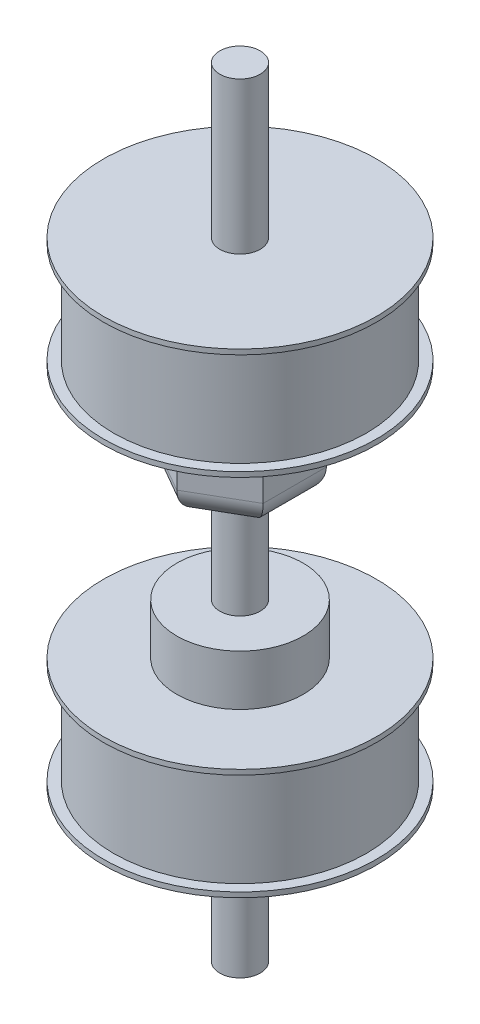
ISO-10303-21;
HEADER;
FILE_DESCRIPTION(('STEP AP214'),'2;1');
FILE_NAME('part.step','',(''),(''),'','','');
FILE_SCHEMA(('AUTOMOTIVE_DESIGN { 1 0 10303 214 1 1 1 1 }'));
ENDSEC;
DATA;
#1=APPLICATION_CONTEXT('core data for automotive mechanical design processes');
#2=APPLICATION_PROTOCOL_DEFINITION('international standard','automotive_design',2000,#1);
#3=PRODUCT_CONTEXT('',#1,'mechanical');
#4=PRODUCT('Part','Part','',(#3));
#5=PRODUCT_RELATED_PRODUCT_CATEGORY('part','',(#4));
#6=PRODUCT_DEFINITION_FORMATION('','',#4);
#7=PRODUCT_DEFINITION_CONTEXT('part definition',#1,'design');
#8=PRODUCT_DEFINITION('design','',#6,#7);
#9=PRODUCT_DEFINITION_SHAPE('','',#8);
#10=(LENGTH_UNIT() NAMED_UNIT(*) SI_UNIT(.MILLI.,.METRE.));
#11=(NAMED_UNIT(*) PLANE_ANGLE_UNIT() SI_UNIT($,.RADIAN.));
#12=(NAMED_UNIT(*) SI_UNIT($,.STERADIAN.) SOLID_ANGLE_UNIT());
#13=UNCERTAINTY_MEASURE_WITH_UNIT(LENGTH_MEASURE(1.E-05),#10,'distance_accuracy_value','');
#14=(GEOMETRIC_REPRESENTATION_CONTEXT(3) GLOBAL_UNCERTAINTY_ASSIGNED_CONTEXT((#13)) GLOBAL_UNIT_ASSIGNED_CONTEXT((#10,
#11,#12)) REPRESENTATION_CONTEXT('',''));
#15=CARTESIAN_POINT('',(0.,0.,0.));
#16=DIRECTION('',(0.,0.,1.));
#17=DIRECTION('',(1.,0.,0.));
#18=AXIS2_PLACEMENT_3D('',#15,#16,#17);
#19=CARTESIAN_POINT('',(0.,-21.,0.));
#20=DIRECTION('',(0.,-1.,0.));
#21=DIRECTION('',(0.,0.,-1.));
#22=AXIS2_PLACEMENT_3D('',#19,#20,#21);
#23=PLANE('',#22);
#24=CARTESIAN_POINT('',(0.,-21.,0.));
#25=DIRECTION('',(0.,-1.,0.));
#26=DIRECTION('',(0.,0.,-1.));
#27=AXIS2_PLACEMENT_3D('',#24,#25,#26);
#28=CIRCLE('',#27,27.);
#29=CARTESIAN_POINT('',(0.,-21.,-27.));
#30=VERTEX_POINT('',#29);
#31=EDGE_CURVE('E469',#30,#30,#28,.T.);
#32=ORIENTED_EDGE('',*,*,#31,.T.);
#33=EDGE_LOOP('',(#32));
#34=FACE_BOUND('',#33,.T.);
#35=CARTESIAN_POINT('',(0.,-21.,0.));
#36=DIRECTION('',(0.,-1.,0.));
#37=DIRECTION('',(0.,0.,-1.));
#38=AXIS2_PLACEMENT_3D('',#35,#36,#37);
#39=CIRCLE('',#38,4.);
#40=CARTESIAN_POINT('',(0.,-21.,-4.));
#41=VERTEX_POINT('',#40);
#42=EDGE_CURVE('E466',#41,#41,#39,.T.);
#43=ORIENTED_EDGE('',*,*,#42,.F.);
#44=EDGE_LOOP('',(#43));
#45=FACE_BOUND('',#44,.T.);
#46=ADVANCED_FACE('F33',(#34,#45),#23,.T.);
#47=CARTESIAN_POINT('',(0.,0.,0.));
#48=DIRECTION('',(0.,1.,0.));
#49=DIRECTION('',(0.,0.,1.));
#50=AXIS2_PLACEMENT_3D('',#47,#48,#49);
#51=PLANE('',#50);
#52=CARTESIAN_POINT('',(0.,0.,0.));
#53=DIRECTION('',(0.,1.,0.));
#54=DIRECTION('',(0.,0.,1.));
#55=AXIS2_PLACEMENT_3D('',#52,#53,#54);
#56=CIRCLE('',#55,27.);
#57=CARTESIAN_POINT('',(0.,0.,27.));
#58=VERTEX_POINT('',#57);
#59=EDGE_CURVE('E153',#58,#58,#56,.T.);
#60=ORIENTED_EDGE('',*,*,#59,.F.);
#61=EDGE_LOOP('',(#60));
#62=FACE_BOUND('',#61,.T.);
#63=CARTESIAN_POINT('',(0.,0.,0.));
#64=DIRECTION('',(0.,1.,0.));
#65=DIRECTION('',(0.,0.,1.));
#66=AXIS2_PLACEMENT_3D('',#63,#64,#65);
#67=CIRCLE('',#66,25.);
#68=CARTESIAN_POINT('',(0.,0.,25.));
#69=VERTEX_POINT('',#68);
#70=EDGE_CURVE('E11',#69,#69,#67,.F.);
#71=ORIENTED_EDGE('',*,*,#70,.F.);
#72=EDGE_LOOP('',(#71));
#73=FACE_BOUND('',#72,.T.);
#74=ADVANCED_FACE('F240',(#62,#73),#51,.F.);
#75=CARTESIAN_POINT('',(0.,73.,0.));
#76=DIRECTION('',(0.,1.,0.));
#77=DIRECTION('',(0.,0.,1.));
#78=AXIS2_PLACEMENT_3D('',#75,#76,#77);
#79=PLANE('',#78);
#80=CARTESIAN_POINT('',(0.,73.,0.));
#81=DIRECTION('',(0.,1.,0.));
#82=DIRECTION('',(0.,0.,1.));
#83=AXIS2_PLACEMENT_3D('',#80,#81,#82);
#84=CIRCLE('',#83,27.);
#85=CARTESIAN_POINT('',(0.,73.,27.));
#86=VERTEX_POINT('',#85);
#87=EDGE_CURVE('E485',#86,#86,#84,.T.);
#88=ORIENTED_EDGE('',*,*,#87,.T.);
#89=EDGE_LOOP('',(#88));
#90=FACE_BOUND('',#89,.T.);
#91=CARTESIAN_POINT('',(0.,73.,0.));
#92=DIRECTION('',(0.,1.,0.));
#93=DIRECTION('',(0.,0.,1.));
#94=AXIS2_PLACEMENT_3D('',#91,#92,#93);
#95=CIRCLE('',#94,4.);
#96=CARTESIAN_POINT('',(0.,73.,4.));
#97=VERTEX_POINT('',#96);
#98=EDGE_CURVE('E478',#97,#97,#95,.T.);
#99=ORIENTED_EDGE('',*,*,#98,.F.);
#100=EDGE_LOOP('',(#99));
#101=FACE_BOUND('',#100,.T.);
#102=ADVANCED_FACE('F246',(#90,#101),#79,.T.);
#103=CARTESIAN_POINT('',(0.,52.,0.));
#104=DIRECTION('',(0.,1.,0.));
#105=DIRECTION('',(0.,0.,1.));
#106=AXIS2_PLACEMENT_3D('',#103,#104,#105);
#107=PLANE('',#106);
#108=CARTESIAN_POINT('',(0.,52.,0.));
#109=DIRECTION('',(0.,1.,0.));
#110=DIRECTION('',(0.,0.,1.));
#111=AXIS2_PLACEMENT_3D('',#108,#109,#110);
#112=CIRCLE('',#111,27.);
#113=CARTESIAN_POINT('',(0.,52.,27.));
#114=VERTEX_POINT('',#113);
#115=EDGE_CURVE('E187',#114,#114,#112,.T.);
#116=ORIENTED_EDGE('',*,*,#115,.T.);
#117=EDGE_LOOP('',(#116));
#118=FACE_BOUND('',#117,.T.);
#119=CARTESIAN_POINT('',(0.,52.,0.));
#120=DIRECTION('',(0.,1.,0.));
#121=DIRECTION('',(0.,0.,1.));
#122=AXIS2_PLACEMENT_3D('',#119,#120,#121);
#123=CIRCLE('',#122,25.);
#124=CARTESIAN_POINT('',(0.,52.,25.));
#125=VERTEX_POINT('',#124);
#126=EDGE_CURVE('E488',#125,#125,#123,.T.);
#127=ORIENTED_EDGE('',*,*,#126,.F.);
#128=EDGE_LOOP('',(#127));
#129=FACE_BOUND('',#128,.T.);
#130=ADVANCED_FACE('F278',(#118,#129),#107,.T.);
#131=CARTESIAN_POINT('',(0.,11.,0.));
#132=DIRECTION('',(0.,1.,0.));
#133=DIRECTION('',(0.,0.,1.));
#134=AXIS2_PLACEMENT_3D('',#131,#132,#133);
#135=PLANE('',#134);
#136=CARTESIAN_POINT('',(0.,11.,0.));
#137=DIRECTION('',(0.,1.,0.));
#138=DIRECTION('',(0.,0.,1.));
#139=AXIS2_PLACEMENT_3D('',#136,#137,#138);
#140=CIRCLE('',#139,12.5);
#141=CARTESIAN_POINT('',(0.,11.,12.5));
#142=VERTEX_POINT('',#141);
#143=EDGE_CURVE('E150',#142,#142,#140,.T.);
#144=ORIENTED_EDGE('',*,*,#143,.T.);
#145=EDGE_LOOP('',(#144));
#146=FACE_BOUND('',#145,.T.);
#147=CARTESIAN_POINT('',(0.,11.,0.));
#148=DIRECTION('',(0.,1.,0.));
#149=DIRECTION('',(0.,0.,1.));
#150=AXIS2_PLACEMENT_3D('',#147,#148,#149);
#151=CIRCLE('',#150,4.);
#152=CARTESIAN_POINT('',(0.,11.,4.));
#153=VERTEX_POINT('',#152);
#154=EDGE_CURVE('E143',#153,#153,#151,.T.);
#155=ORIENTED_EDGE('',*,*,#154,.F.);
#156=EDGE_LOOP('',(#155));
#157=FACE_BOUND('',#156,.T.);
#158=ADVANCED_FACE('F294',(#146,#157),#135,.T.);
#159=CARTESIAN_POINT('',(0.,1.,0.));
#160=DIRECTION('',(0.,1.,0.));
#161=DIRECTION('',(0.,0.,1.));
#162=AXIS2_PLACEMENT_3D('',#159,#160,#161);
#163=PLANE('',#162);
#164=CARTESIAN_POINT('',(0.,1.,0.));
#165=DIRECTION('',(0.,1.,0.));
#166=DIRECTION('',(0.,0.,1.));
#167=AXIS2_PLACEMENT_3D('',#164,#165,#166);
#168=CIRCLE('',#167,27.);
#169=CARTESIAN_POINT('',(0.,1.,27.));
#170=VERTEX_POINT('',#169);
#171=EDGE_CURVE('E156',#170,#170,#168,.T.);
#172=ORIENTED_EDGE('',*,*,#171,.T.);
#173=EDGE_LOOP('',(#172));
#174=FACE_BOUND('',#173,.T.);
#175=CARTESIAN_POINT('',(0.,1.,0.));
#176=DIRECTION('',(0.,1.,0.));
#177=DIRECTION('',(0.,0.,1.));
#178=AXIS2_PLACEMENT_3D('',#175,#176,#177);
#179=CIRCLE('',#178,12.5);
#180=CARTESIAN_POINT('',(0.,1.,12.5));
#181=VERTEX_POINT('',#180);
#182=EDGE_CURVE('E147',#181,#181,#179,.T.);
#183=ORIENTED_EDGE('',*,*,#182,.F.);
#184=EDGE_LOOP('',(#183));
#185=FACE_BOUND('',#184,.T.);
#186=ADVANCED_FACE('F324',(#174,#185),#163,.T.);
#187=CARTESIAN_POINT('',(0.,1.,0.));
#188=DIRECTION('',(0.,-1.,0.));
#189=DIRECTION('',(0.,0.,-1.));
#190=AXIS2_PLACEMENT_3D('',#187,#188,#189);
#191=CYLINDRICAL_SURFACE('',#190,27.);
#192=ORIENTED_EDGE('',*,*,#171,.F.);
#193=EDGE_LOOP('',(#192));
#194=FACE_BOUND('',#193,.T.);
#195=ORIENTED_EDGE('',*,*,#59,.T.);
#196=EDGE_LOOP('',(#195));
#197=FACE_BOUND('',#196,.T.);
#198=ADVANCED_FACE('F316',(#194,#197),#191,.T.);
#199=CARTESIAN_POINT('',(0.,11.,0.));
#200=DIRECTION('',(0.,-1.,0.));
#201=DIRECTION('',(0.,0.,-1.));
#202=AXIS2_PLACEMENT_3D('',#199,#200,#201);
#203=CYLINDRICAL_SURFACE('',#202,12.5);
#204=ORIENTED_EDGE('',*,*,#143,.F.);
#205=EDGE_LOOP('',(#204));
#206=FACE_BOUND('',#205,.T.);
#207=ORIENTED_EDGE('',*,*,#182,.T.);
#208=EDGE_LOOP('',(#207));
#209=FACE_BOUND('',#208,.T.);
#210=ADVANCED_FACE('F310',(#206,#209),#203,.T.);
#211=CARTESIAN_POINT('',(0.,31.,0.));
#212=DIRECTION('',(0.,-1.,0.));
#213=DIRECTION('',(0.,0.,-1.));
#214=AXIS2_PLACEMENT_3D('',#211,#212,#213);
#215=CYLINDRICAL_SURFACE('',#214,4.);
#216=CARTESIAN_POINT('',(0.,31.,0.));
#217=DIRECTION('',(0.,1.,0.));
#218=DIRECTION('',(0.,0.,1.));
#219=AXIS2_PLACEMENT_3D('',#216,#217,#218);
#220=CIRCLE('',#219,4.);
#221=CARTESIAN_POINT('',(0.,31.,4.));
#222=VERTEX_POINT('',#221);
#223=EDGE_CURVE('E144',#222,#222,#220,.T.);
#224=ORIENTED_EDGE('',*,*,#223,.F.);
#225=EDGE_LOOP('',(#224));
#226=FACE_BOUND('',#225,.T.);
#227=ORIENTED_EDGE('',*,*,#154,.T.);
#228=EDGE_LOOP('',(#227));
#229=FACE_BOUND('',#228,.T.);
#230=ADVANCED_FACE('F304',(#226,#229),#215,.T.);
#231=CARTESIAN_POINT('',(0.,31.,0.));
#232=DIRECTION('',(0.,-1.,0.));
#233=DIRECTION('',(0.,0.,-1.));
#234=AXIS2_PLACEMENT_3D('',#231,#232,#233);
#235=PLANE('',#234);
#236=DIRECTION('',(0.866025403784439,0.,0.5));
#237=VECTOR('',#236,1.);
#238=CARTESIAN_POINT('',(-8.32531754730549,31.,1.91987298107782));
#239=LINE('',#238,#237);
#240=CARTESIAN_POINT('',(0.,31.,6.72649730810376));
#241=VERTEX_POINT('',#240);
#242=CARTESIAN_POINT('',(-5.82531754730549,31.,3.36324865405189));
#243=VERTEX_POINT('',#242);
#244=EDGE_CURVE('E172',#241,#243,#239,.F.);
#245=ORIENTED_EDGE('',*,*,#244,.T.);
#246=DIRECTION('',(0.,0.,1.));
#247=VECTOR('',#246,1.);
#248=CARTESIAN_POINT('',(-5.82531754730549,31.,-6.25));
#249=LINE('',#248,#247);
#250=CARTESIAN_POINT('',(-5.82531754730549,31.,-3.36324865405187));
#251=VERTEX_POINT('',#250);
#252=EDGE_CURVE('E174',#243,#251,#249,.F.);
#253=ORIENTED_EDGE('',*,*,#252,.T.);
#254=DIRECTION('',(-0.866025403784439,0.,0.5));
#255=VECTOR('',#254,1.);
#256=CARTESIAN_POINT('',(2.5,31.,-8.16987298107781));
#257=LINE('',#256,#255);
#258=CARTESIAN_POINT('',(0.,31.,-6.72649730810374));
#259=VERTEX_POINT('',#258);
#260=EDGE_CURVE('E164',#251,#259,#257,.F.);
#261=ORIENTED_EDGE('',*,*,#260,.T.);
#262=DIRECTION('',(-0.866025403784439,0.,-0.5));
#263=VECTOR('',#262,1.);
#264=CARTESIAN_POINT('',(8.32531754730549,31.,-1.91987298107781));
#265=LINE('',#264,#263);
#266=CARTESIAN_POINT('',(5.82531754730549,31.,-3.36324865405187));
#267=VERTEX_POINT('',#266);
#268=EDGE_CURVE('E166',#259,#267,#265,.F.);
#269=ORIENTED_EDGE('',*,*,#268,.T.);
#270=DIRECTION('',(0.,0.,-1.));
#271=VECTOR('',#270,1.);
#272=CARTESIAN_POINT('',(5.82531754730549,31.,6.25000000000001));
#273=LINE('',#272,#271);
#274=CARTESIAN_POINT('',(5.82531754730549,31.,3.36324865405188));
#275=VERTEX_POINT('',#274);
#276=EDGE_CURVE('E168',#267,#275,#273,.F.);
#277=ORIENTED_EDGE('',*,*,#276,.T.);
#278=DIRECTION('',(0.866025403784439,0.,-0.5));
#279=VECTOR('',#278,1.);
#280=CARTESIAN_POINT('',(-2.50000000000001,31.,8.16987298107783));
#281=LINE('',#280,#279);
#282=EDGE_CURVE('E170',#275,#241,#281,.F.);
#283=ORIENTED_EDGE('',*,*,#282,.T.);
#284=EDGE_LOOP('',(#245,#253,#261,#269,#277,#283));
#285=FACE_BOUND('',#284,.T.);
#286=ORIENTED_EDGE('',*,*,#223,.T.);
#287=EDGE_LOOP('',(#286));
#288=FACE_BOUND('',#287,.T.);
#289=ADVANCED_FACE('F207',(#285,#288),#235,.T.);
#290=CARTESIAN_POINT('',(-10.8253175473055,51.,-6.25));
#291=DIRECTION('',(0.5,0.,0.866025403784439));
#292=DIRECTION('',(0.866025403784439,0.,-0.5));
#293=AXIS2_PLACEMENT_3D('',#290,#291,#292);
#294=PLANE('',#293);
#295=DIRECTION('',(0.,-1.,0.));
#296=VECTOR('',#295,1.);
#297=CARTESIAN_POINT('',(0.,51.,-12.5));
#298=LINE('',#297,#296);
#299=CARTESIAN_POINT('',(0.,51.,-12.5));
#300=VERTEX_POINT('',#299);
#301=CARTESIAN_POINT('',(0.,36.,-12.5));
#302=VERTEX_POINT('',#301);
#303=EDGE_CURVE('E108',#300,#302,#298,.T.);
#304=ORIENTED_EDGE('',*,*,#303,.T.);
#305=DIRECTION('',(-0.866025403784439,0.,0.5));
#306=VECTOR('',#305,1.);
#307=CARTESIAN_POINT('',(-10.8253175473055,36.,-6.25));
#308=LINE('',#307,#306);
#309=CARTESIAN_POINT('',(-10.8253175473055,36.,-6.25));
#310=VERTEX_POINT('',#309);
#311=EDGE_CURVE('E41',#302,#310,#308,.T.);
#312=ORIENTED_EDGE('',*,*,#311,.T.);
#313=DIRECTION('',(0.,-1.,0.));
#314=VECTOR('',#313,1.);
#315=CARTESIAN_POINT('',(-10.8253175473055,51.,-6.25));
#316=LINE('',#315,#314);
#317=CARTESIAN_POINT('',(-10.8253175473055,51.,-6.25));
#318=VERTEX_POINT('',#317);
#319=EDGE_CURVE('E111',#318,#310,#316,.T.);
#320=ORIENTED_EDGE('',*,*,#319,.F.);
#321=DIRECTION('',(-0.866025403784439,0.,0.5));
#322=VECTOR('',#321,1.);
#323=CARTESIAN_POINT('',(-10.8253175473055,51.,-6.25));
#324=LINE('',#323,#322);
#325=EDGE_CURVE('E106',#300,#318,#324,.T.);
#326=ORIENTED_EDGE('',*,*,#325,.F.);
#327=EDGE_LOOP('',(#304,#312,#320,#326));
#328=FACE_BOUND('',#327,.T.);
#329=ADVANCED_FACE('F107',(#328),#294,.F.);
#330=CARTESIAN_POINT('',(-10.8253175473055,51.,6.25000000000002));
#331=DIRECTION('',(1.,0.,0.));
#332=DIRECTION('',(0.,0.,-1.));
#333=AXIS2_PLACEMENT_3D('',#330,#331,#332);
#334=PLANE('',#333);
#335=ORIENTED_EDGE('',*,*,#319,.T.);
#336=DIRECTION('',(0.,0.,1.));
#337=VECTOR('',#336,1.);
#338=CARTESIAN_POINT('',(-10.8253175473055,36.,6.25000000000002));
#339=LINE('',#338,#337);
#340=CARTESIAN_POINT('',(-10.8253175473055,36.,6.25000000000002));
#341=VERTEX_POINT('',#340);
#342=EDGE_CURVE('E159',#310,#341,#339,.T.);
#343=ORIENTED_EDGE('',*,*,#342,.T.);
#344=DIRECTION('',(0.,-1.,0.));
#345=VECTOR('',#344,1.);
#346=CARTESIAN_POINT('',(-10.8253175473055,51.,6.25000000000002));
#347=LINE('',#346,#345);
#348=CARTESIAN_POINT('',(-10.8253175473055,51.,6.25000000000002));
#349=VERTEX_POINT('',#348);
#350=EDGE_CURVE('E139',#349,#341,#347,.T.);
#351=ORIENTED_EDGE('',*,*,#350,.F.);
#352=DIRECTION('',(0.,0.,1.));
#353=VECTOR('',#352,1.);
#354=CARTESIAN_POINT('',(-10.8253175473055,51.,6.25000000000002));
#355=LINE('',#354,#353);
#356=EDGE_CURVE('E115',#318,#349,#355,.T.);
#357=ORIENTED_EDGE('',*,*,#356,.F.);
#358=EDGE_LOOP('',(#335,#343,#351,#357));
#359=FACE_BOUND('',#358,.T.);
#360=ADVANCED_FACE('F218',(#359),#334,.F.);
#361=CARTESIAN_POINT('',(0.,51.,12.5));
#362=DIRECTION('',(0.5,0.,-0.866025403784439));
#363=DIRECTION('',(-0.866025403784439,0.,-0.5));
#364=AXIS2_PLACEMENT_3D('',#361,#362,#363);
#365=PLANE('',#364);
#366=ORIENTED_EDGE('',*,*,#350,.T.);
#367=DIRECTION('',(0.866025403784439,0.,0.5));
#368=VECTOR('',#367,1.);
#369=CARTESIAN_POINT('',(0.,36.,12.5));
#370=LINE('',#369,#368);
#371=CARTESIAN_POINT('',(0.,36.,12.5));
#372=VERTEX_POINT('',#371);
#373=EDGE_CURVE('E177',#341,#372,#370,.T.);
#374=ORIENTED_EDGE('',*,*,#373,.T.);
#375=DIRECTION('',(0.,-1.,0.));
#376=VECTOR('',#375,1.);
#377=CARTESIAN_POINT('',(0.,51.,12.5));
#378=LINE('',#377,#376);
#379=CARTESIAN_POINT('',(0.,51.,12.5));
#380=VERTEX_POINT('',#379);
#381=EDGE_CURVE('E136',#380,#372,#378,.T.);
#382=ORIENTED_EDGE('',*,*,#381,.F.);
#383=DIRECTION('',(0.866025403784439,0.,0.5));
#384=VECTOR('',#383,1.);
#385=CARTESIAN_POINT('',(0.,51.,12.5));
#386=LINE('',#385,#384);
#387=EDGE_CURVE('E221',#349,#380,#386,.T.);
#388=ORIENTED_EDGE('',*,*,#387,.F.);
#389=EDGE_LOOP('',(#366,#374,#382,#388));
#390=FACE_BOUND('',#389,.T.);
#391=ADVANCED_FACE('F237',(#390),#365,.F.);
#392=CARTESIAN_POINT('',(10.8253175473055,51.,6.25000000000001));
#393=DIRECTION('',(-0.5,0.,-0.866025403784439));
#394=DIRECTION('',(-0.866025403784439,0.,0.5));
#395=AXIS2_PLACEMENT_3D('',#392,#393,#394);
#396=PLANE('',#395);
#397=ORIENTED_EDGE('',*,*,#381,.T.);
#398=DIRECTION('',(0.866025403784439,0.,-0.5));
#399=VECTOR('',#398,1.);
#400=CARTESIAN_POINT('',(10.8253175473055,36.,6.25000000000001));
#401=LINE('',#400,#399);
#402=CARTESIAN_POINT('',(10.8253175473055,36.,6.25000000000001));
#403=VERTEX_POINT('',#402);
#404=EDGE_CURVE('E179',#372,#403,#401,.T.);
#405=ORIENTED_EDGE('',*,*,#404,.T.);
#406=DIRECTION('',(0.,-1.,0.));
#407=VECTOR('',#406,1.);
#408=CARTESIAN_POINT('',(10.8253175473055,51.,6.25000000000001));
#409=LINE('',#408,#407);
#410=CARTESIAN_POINT('',(10.8253175473055,51.,6.25000000000001));
#411=VERTEX_POINT('',#410);
#412=EDGE_CURVE('E134',#411,#403,#409,.T.);
#413=ORIENTED_EDGE('',*,*,#412,.F.);
#414=DIRECTION('',(0.866025403784439,0.,-0.5));
#415=VECTOR('',#414,1.);
#416=CARTESIAN_POINT('',(10.8253175473055,51.,6.25000000000001));
#417=LINE('',#416,#415);
#418=EDGE_CURVE('E129',#380,#411,#417,.T.);
#419=ORIENTED_EDGE('',*,*,#418,.F.);
#420=EDGE_LOOP('',(#397,#405,#413,#419));
#421=FACE_BOUND('',#420,.T.);
#422=ADVANCED_FACE('F227',(#421),#396,.F.);
#423=CARTESIAN_POINT('',(10.8253175473055,51.,-6.25));
#424=DIRECTION('',(-1.,0.,0.));
#425=DIRECTION('',(0.,0.,1.));
#426=AXIS2_PLACEMENT_3D('',#423,#424,#425);
#427=PLANE('',#426);
#428=ORIENTED_EDGE('',*,*,#412,.T.);
#429=DIRECTION('',(0.,0.,-1.));
#430=VECTOR('',#429,1.);
#431=CARTESIAN_POINT('',(10.8253175473055,36.,-6.25));
#432=LINE('',#431,#430);
#433=CARTESIAN_POINT('',(10.8253175473055,36.,-6.25));
#434=VERTEX_POINT('',#433);
#435=EDGE_CURVE('E56',#403,#434,#432,.T.);
#436=ORIENTED_EDGE('',*,*,#435,.T.);
#437=DIRECTION('',(0.,-1.,0.));
#438=VECTOR('',#437,1.);
#439=CARTESIAN_POINT('',(10.8253175473055,51.,-6.25));
#440=LINE('',#439,#438);
#441=CARTESIAN_POINT('',(10.8253175473055,51.,-6.25));
#442=VERTEX_POINT('',#441);
#443=EDGE_CURVE('E122',#442,#434,#440,.T.);
#444=ORIENTED_EDGE('',*,*,#443,.F.);
#445=DIRECTION('',(0.,0.,-1.));
#446=VECTOR('',#445,1.);
#447=CARTESIAN_POINT('',(10.8253175473055,51.,-6.25));
#448=LINE('',#447,#446);
#449=EDGE_CURVE('E127',#411,#442,#448,.T.);
#450=ORIENTED_EDGE('',*,*,#449,.F.);
#451=EDGE_LOOP('',(#428,#436,#444,#450));
#452=FACE_BOUND('',#451,.T.);
#453=ADVANCED_FACE('F229',(#452),#427,.F.);
#454=CARTESIAN_POINT('',(0.,51.,-12.5));
#455=DIRECTION('',(-0.5,0.,0.866025403784439));
#456=DIRECTION('',(0.866025403784439,0.,0.5));
#457=AXIS2_PLACEMENT_3D('',#454,#455,#456);
#458=PLANE('',#457);
#459=ORIENTED_EDGE('',*,*,#443,.T.);
#460=DIRECTION('',(-0.866025403784439,0.,-0.5));
#461=VECTOR('',#460,1.);
#462=CARTESIAN_POINT('',(0.,36.,-12.5));
#463=LINE('',#462,#461);
#464=EDGE_CURVE('E48',#434,#302,#463,.T.);
#465=ORIENTED_EDGE('',*,*,#464,.T.);
#466=ORIENTED_EDGE('',*,*,#303,.F.);
#467=DIRECTION('',(-0.866025403784439,0.,-0.5));
#468=VECTOR('',#467,1.);
#469=CARTESIAN_POINT('',(0.,51.,-12.5));
#470=LINE('',#469,#468);
#471=EDGE_CURVE('E120',#442,#300,#470,.T.);
#472=ORIENTED_EDGE('',*,*,#471,.F.);
#473=EDGE_LOOP('',(#459,#465,#466,#472));
#474=FACE_BOUND('',#473,.T.);
#475=ADVANCED_FACE('F119',(#474),#458,.F.);
#476=CARTESIAN_POINT('',(5.82531754730548,36.,-6.25));
#477=DIRECTION('',(0.,0.,1.));
#478=DIRECTION('',(1.,0.,0.));
#479=AXIS2_PLACEMENT_3D('',#476,#477,#478);
#480=CYLINDRICAL_SURFACE('',#479,5.);
#481=CARTESIAN_POINT('',(5.82531754730549,36.,3.36324865405188));
#482=DIRECTION('',(-0.5,0.,0.866025403784439));
#483=DIRECTION('',(0.866025403784439,0.,0.5));
#484=AXIS2_PLACEMENT_3D('',#481,#482,#483);
#485=ELLIPSE('',#484,5.77350269189626,5.);
#486=EDGE_CURVE('E195',#275,#403,#485,.T.);
#487=ORIENTED_EDGE('',*,*,#486,.F.);
#488=ORIENTED_EDGE('',*,*,#276,.F.);
#489=CARTESIAN_POINT('',(5.82531754730549,36.,-3.36324865405187));
#490=DIRECTION('',(0.5,0.,0.866025403784438));
#491=DIRECTION('',(0.866025403784439,0.,-0.5));
#492=AXIS2_PLACEMENT_3D('',#489,#490,#491);
#493=ELLIPSE('',#492,5.77350269189626,5.);
#494=EDGE_CURVE('E116',#434,#267,#493,.F.);
#495=ORIENTED_EDGE('',*,*,#494,.F.);
#496=ORIENTED_EDGE('',*,*,#435,.F.);
#497=EDGE_LOOP('',(#487,#488,#495,#496));
#498=FACE_BOUND('',#497,.T.);
#499=ADVANCED_FACE('F35',(#498),#480,.T.);
#500=CARTESIAN_POINT('',(-2.5,36.,-8.16987298107781));
#501=DIRECTION('',(0.866025403784439,0.,0.5));
#502=DIRECTION('',(0.5,0.,-0.866025403784439));
#503=AXIS2_PLACEMENT_3D('',#500,#501,#502);
#504=CYLINDRICAL_SURFACE('',#503,5.);
#505=ORIENTED_EDGE('',*,*,#494,.T.);
#506=ORIENTED_EDGE('',*,*,#268,.F.);
#507=CARTESIAN_POINT('',(0.,36.,-6.72649730810374));
#508=DIRECTION('',(1.,0.,0.));
#509=DIRECTION('',(0.,0.,-1.));
#510=AXIS2_PLACEMENT_3D('',#507,#508,#509);
#511=ELLIPSE('',#510,5.77350269189626,5.);
#512=EDGE_CURVE('E192',#302,#259,#511,.F.);
#513=ORIENTED_EDGE('',*,*,#512,.F.);
#514=ORIENTED_EDGE('',*,*,#464,.F.);
#515=EDGE_LOOP('',(#505,#506,#513,#514));
#516=FACE_BOUND('',#515,.T.);
#517=ADVANCED_FACE('F201',(#516),#504,.T.);
#518=CARTESIAN_POINT('',(8.32531754730549,36.,1.91987298107782));
#519=DIRECTION('',(-0.866025403784439,0.,0.5));
#520=DIRECTION('',(0.5,0.,0.866025403784439));
#521=AXIS2_PLACEMENT_3D('',#518,#519,#520);
#522=CYLINDRICAL_SURFACE('',#521,5.);
#523=ORIENTED_EDGE('',*,*,#486,.T.);
#524=ORIENTED_EDGE('',*,*,#404,.F.);
#525=CARTESIAN_POINT('',(0.,36.,6.72649730810376));
#526=DIRECTION('',(-1.,0.,0.));
#527=DIRECTION('',(0.,0.,1.));
#528=AXIS2_PLACEMENT_3D('',#525,#526,#527);
#529=ELLIPSE('',#528,5.77350269189626,5.);
#530=EDGE_CURVE('E189',#241,#372,#529,.T.);
#531=ORIENTED_EDGE('',*,*,#530,.F.);
#532=ORIENTED_EDGE('',*,*,#282,.F.);
#533=EDGE_LOOP('',(#523,#524,#531,#532));
#534=FACE_BOUND('',#533,.T.);
#535=ADVANCED_FACE('F342',(#534),#522,.T.);
#536=CARTESIAN_POINT('',(-8.32531754730549,36.,-1.9198729810778));
#537=DIRECTION('',(0.866025403784439,0.,-0.5));
#538=DIRECTION('',(-0.5,0.,-0.866025403784439));
#539=AXIS2_PLACEMENT_3D('',#536,#537,#538);
#540=CYLINDRICAL_SURFACE('',#539,5.);
#541=ORIENTED_EDGE('',*,*,#512,.T.);
#542=ORIENTED_EDGE('',*,*,#260,.F.);
#543=CARTESIAN_POINT('',(-5.82531754730549,36.,-3.36324865405187));
#544=DIRECTION('',(0.5,0.,-0.866025403784439));
#545=DIRECTION('',(0.866025403784439,0.,0.5));
#546=AXIS2_PLACEMENT_3D('',#543,#544,#545);
#547=ELLIPSE('',#546,5.77350269189626,5.);
#548=EDGE_CURVE('E186',#310,#251,#547,.F.);
#549=ORIENTED_EDGE('',*,*,#548,.F.);
#550=ORIENTED_EDGE('',*,*,#311,.F.);
#551=EDGE_LOOP('',(#541,#542,#549,#550));
#552=FACE_BOUND('',#551,.T.);
#553=ADVANCED_FACE('F214',(#552),#540,.T.);
#554=CARTESIAN_POINT('',(2.5,36.,8.16987298107782));
#555=DIRECTION('',(-0.866025403784439,0.,-0.5));
#556=DIRECTION('',(-0.5,0.,0.866025403784439));
#557=AXIS2_PLACEMENT_3D('',#554,#555,#556);
#558=CYLINDRICAL_SURFACE('',#557,5.);
#559=ORIENTED_EDGE('',*,*,#530,.T.);
#560=ORIENTED_EDGE('',*,*,#373,.F.);
#561=CARTESIAN_POINT('',(-5.82531754730549,36.,3.36324865405189));
#562=DIRECTION('',(-0.5,0.,-0.866025403784439));
#563=DIRECTION('',(-0.866025403784438,0.,0.5));
#564=AXIS2_PLACEMENT_3D('',#561,#562,#563);
#565=ELLIPSE('',#564,5.77350269189626,5.);
#566=EDGE_CURVE('E184',#243,#341,#565,.T.);
#567=ORIENTED_EDGE('',*,*,#566,.F.);
#568=ORIENTED_EDGE('',*,*,#244,.F.);
#569=EDGE_LOOP('',(#559,#560,#567,#568));
#570=FACE_BOUND('',#569,.T.);
#571=ADVANCED_FACE('F335',(#570),#558,.T.);
#572=CARTESIAN_POINT('',(-5.82531754730549,36.,6.25000000000001));
#573=DIRECTION('',(0.,0.,-1.));
#574=DIRECTION('',(-1.,0.,0.));
#575=AXIS2_PLACEMENT_3D('',#572,#573,#574);
#576=CYLINDRICAL_SURFACE('',#575,5.);
#577=ORIENTED_EDGE('',*,*,#548,.T.);
#578=ORIENTED_EDGE('',*,*,#252,.F.);
#579=ORIENTED_EDGE('',*,*,#566,.T.);
#580=ORIENTED_EDGE('',*,*,#342,.F.);
#581=EDGE_LOOP('',(#577,#578,#579,#580));
#582=FACE_BOUND('',#581,.T.);
#583=ADVANCED_FACE('F298',(#582),#576,.T.);
#584=CARTESIAN_POINT('',(0.,51.,0.));
#585=DIRECTION('',(0.,1.,0.));
#586=DIRECTION('',(0.,0.,1.));
#587=AXIS2_PLACEMENT_3D('',#584,#585,#586);
#588=PLANE('',#587);
#589=CARTESIAN_POINT('',(0.,51.,0.));
#590=DIRECTION('',(0.,1.,0.));
#591=DIRECTION('',(0.,0.,1.));
#592=AXIS2_PLACEMENT_3D('',#589,#590,#591);
#593=CIRCLE('',#592,27.);
#594=CARTESIAN_POINT('',(0.,51.,27.));
#595=VERTEX_POINT('',#594);
#596=EDGE_CURVE('E494',#595,#595,#593,.T.);
#597=ORIENTED_EDGE('',*,*,#596,.F.);
#598=EDGE_LOOP('',(#597));
#599=FACE_BOUND('',#598,.T.);
#600=ORIENTED_EDGE('',*,*,#471,.T.);
#601=ORIENTED_EDGE('',*,*,#325,.T.);
#602=ORIENTED_EDGE('',*,*,#356,.T.);
#603=ORIENTED_EDGE('',*,*,#387,.T.);
#604=ORIENTED_EDGE('',*,*,#418,.T.);
#605=ORIENTED_EDGE('',*,*,#449,.T.);
#606=EDGE_LOOP('',(#600,#601,#602,#603,#604,#605));
#607=FACE_BOUND('',#606,.T.);
#608=ADVANCED_FACE('F124',(#599,#607),#588,.F.);
#609=CARTESIAN_POINT('',(0.,52.,0.));
#610=DIRECTION('',(0.,-1.,0.));
#611=DIRECTION('',(0.,0.,-1.));
#612=AXIS2_PLACEMENT_3D('',#609,#610,#611);
#613=CYLINDRICAL_SURFACE('',#612,27.);
#614=ORIENTED_EDGE('',*,*,#115,.F.);
#615=EDGE_LOOP('',(#614));
#616=FACE_BOUND('',#615,.T.);
#617=ORIENTED_EDGE('',*,*,#596,.T.);
#618=EDGE_LOOP('',(#617));
#619=FACE_BOUND('',#618,.T.);
#620=ADVANCED_FACE('F290',(#616,#619),#613,.T.);
#621=CARTESIAN_POINT('',(0.,72.,0.));
#622=DIRECTION('',(0.,-1.,0.));
#623=DIRECTION('',(0.,0.,-1.));
#624=AXIS2_PLACEMENT_3D('',#621,#622,#623);
#625=CYLINDRICAL_SURFACE('',#624,25.);
#626=CARTESIAN_POINT('',(0.,72.,0.));
#627=DIRECTION('',(0.,1.,0.));
#628=DIRECTION('',(0.,0.,1.));
#629=AXIS2_PLACEMENT_3D('',#626,#627,#628);
#630=CIRCLE('',#629,25.);
#631=CARTESIAN_POINT('',(0.,72.,25.));
#632=VERTEX_POINT('',#631);
#633=EDGE_CURVE('E491',#632,#632,#630,.T.);
#634=ORIENTED_EDGE('',*,*,#633,.F.);
#635=EDGE_LOOP('',(#634));
#636=FACE_BOUND('',#635,.T.);
#637=ORIENTED_EDGE('',*,*,#126,.T.);
#638=EDGE_LOOP('',(#637));
#639=FACE_BOUND('',#638,.T.);
#640=ADVANCED_FACE('F283',(#636,#639),#625,.T.);
#641=CARTESIAN_POINT('',(0.,72.,0.));
#642=DIRECTION('',(0.,1.,0.));
#643=DIRECTION('',(0.,0.,1.));
#644=AXIS2_PLACEMENT_3D('',#641,#642,#643);
#645=PLANE('',#644);
#646=CARTESIAN_POINT('',(0.,72.,0.));
#647=DIRECTION('',(0.,1.,0.));
#648=DIRECTION('',(0.,0.,1.));
#649=AXIS2_PLACEMENT_3D('',#646,#647,#648);
#650=CIRCLE('',#649,27.);
#651=CARTESIAN_POINT('',(0.,72.,27.));
#652=VERTEX_POINT('',#651);
#653=EDGE_CURVE('E482',#652,#652,#650,.T.);
#654=ORIENTED_EDGE('',*,*,#653,.F.);
#655=EDGE_LOOP('',(#654));
#656=FACE_BOUND('',#655,.T.);
#657=ORIENTED_EDGE('',*,*,#633,.T.);
#658=EDGE_LOOP('',(#657));
#659=FACE_BOUND('',#658,.T.);
#660=ADVANCED_FACE('F280',(#656,#659),#645,.F.);
#661=CARTESIAN_POINT('',(0.,73.,0.));
#662=DIRECTION('',(0.,-1.,0.));
#663=DIRECTION('',(0.,0.,-1.));
#664=AXIS2_PLACEMENT_3D('',#661,#662,#663);
#665=CYLINDRICAL_SURFACE('',#664,27.);
#666=ORIENTED_EDGE('',*,*,#87,.F.);
#667=EDGE_LOOP('',(#666));
#668=FACE_BOUND('',#667,.T.);
#669=ORIENTED_EDGE('',*,*,#653,.T.);
#670=EDGE_LOOP('',(#669));
#671=FACE_BOUND('',#670,.T.);
#672=ADVANCED_FACE('F274',(#668,#671),#665,.T.);
#673=CARTESIAN_POINT('',(0.,103.,0.));
#674=DIRECTION('',(0.,-1.,0.));
#675=DIRECTION('',(0.,0.,-1.));
#676=AXIS2_PLACEMENT_3D('',#673,#674,#675);
#677=CYLINDRICAL_SURFACE('',#676,4.);
#678=CARTESIAN_POINT('',(0.,103.,0.));
#679=DIRECTION('',(0.,1.,0.));
#680=DIRECTION('',(0.,0.,1.));
#681=AXIS2_PLACEMENT_3D('',#678,#679,#680);
#682=CIRCLE('',#681,4.);
#683=CARTESIAN_POINT('',(0.,103.,4.));
#684=VERTEX_POINT('',#683);
#685=EDGE_CURVE('E479',#684,#684,#682,.T.);
#686=ORIENTED_EDGE('',*,*,#685,.F.);
#687=EDGE_LOOP('',(#686));
#688=FACE_BOUND('',#687,.T.);
#689=ORIENTED_EDGE('',*,*,#98,.T.);
#690=EDGE_LOOP('',(#689));
#691=FACE_BOUND('',#690,.T.);
#692=ADVANCED_FACE('F270',(#688,#691),#677,.T.);
#693=CARTESIAN_POINT('',(0.,103.,0.));
#694=DIRECTION('',(0.,1.,0.));
#695=DIRECTION('',(0.,0.,1.));
#696=AXIS2_PLACEMENT_3D('',#693,#694,#695);
#697=PLANE('',#696);
#698=ORIENTED_EDGE('',*,*,#685,.T.);
#699=EDGE_LOOP('',(#698));
#700=FACE_BOUND('',#699,.T.);
#701=ADVANCED_FACE('F266',(#700),#697,.T.);
#702=CARTESIAN_POINT('',(0.,-20.,0.));
#703=DIRECTION('',(0.,1.,0.));
#704=DIRECTION('',(0.,0.,1.));
#705=AXIS2_PLACEMENT_3D('',#702,#703,#704);
#706=CYLINDRICAL_SURFACE('',#705,25.);
#707=CARTESIAN_POINT('',(0.,-20.,0.));
#708=DIRECTION('',(0.,-1.,0.));
#709=DIRECTION('',(0.,0.,-1.));
#710=AXIS2_PLACEMENT_3D('',#707,#708,#709);
#711=CIRCLE('',#710,25.);
#712=CARTESIAN_POINT('',(0.,-20.,-25.));
#713=VERTEX_POINT('',#712);
#714=EDGE_CURVE('E474',#713,#713,#711,.T.);
#715=ORIENTED_EDGE('',*,*,#714,.F.);
#716=EDGE_LOOP('',(#715));
#717=FACE_BOUND('',#716,.T.);
#718=ORIENTED_EDGE('',*,*,#70,.T.);
#719=EDGE_LOOP('',(#718));
#720=FACE_BOUND('',#719,.T.);
#721=ADVANCED_FACE('F259',(#717,#720),#706,.T.);
#722=CARTESIAN_POINT('',(0.,-20.,0.));
#723=DIRECTION('',(0.,-1.,0.));
#724=DIRECTION('',(0.,0.,-1.));
#725=AXIS2_PLACEMENT_3D('',#722,#723,#724);
#726=PLANE('',#725);
#727=CARTESIAN_POINT('',(0.,-20.,0.));
#728=DIRECTION('',(0.,-1.,0.));
#729=DIRECTION('',(0.,0.,-1.));
#730=AXIS2_PLACEMENT_3D('',#727,#728,#729);
#731=CIRCLE('',#730,27.);
#732=CARTESIAN_POINT('',(0.,-20.,-27.));
#733=VERTEX_POINT('',#732);
#734=EDGE_CURVE('E465',#733,#733,#731,.T.);
#735=ORIENTED_EDGE('',*,*,#734,.F.);
#736=EDGE_LOOP('',(#735));
#737=FACE_BOUND('',#736,.T.);
#738=ORIENTED_EDGE('',*,*,#714,.T.);
#739=EDGE_LOOP('',(#738));
#740=FACE_BOUND('',#739,.T.);
#741=ADVANCED_FACE('F255',(#737,#740),#726,.F.);
#742=CARTESIAN_POINT('',(0.,-21.,0.));
#743=DIRECTION('',(0.,1.,0.));
#744=DIRECTION('',(0.,0.,1.));
#745=AXIS2_PLACEMENT_3D('',#742,#743,#744);
#746=CYLINDRICAL_SURFACE('',#745,27.);
#747=ORIENTED_EDGE('',*,*,#31,.F.);
#748=EDGE_LOOP('',(#747));
#749=FACE_BOUND('',#748,.T.);
#750=ORIENTED_EDGE('',*,*,#734,.T.);
#751=EDGE_LOOP('',(#750));
#752=FACE_BOUND('',#751,.T.);
#753=ADVANCED_FACE('F258',(#749,#752),#746,.T.);
#754=CARTESIAN_POINT('',(0.,-51.,0.));
#755=DIRECTION('',(0.,1.,0.));
#756=DIRECTION('',(0.,0.,1.));
#757=AXIS2_PLACEMENT_3D('',#754,#755,#756);
#758=CYLINDRICAL_SURFACE('',#757,4.);
#759=CARTESIAN_POINT('',(0.,-51.,0.));
#760=DIRECTION('',(0.,-1.,0.));
#761=DIRECTION('',(0.,0.,-1.));
#762=AXIS2_PLACEMENT_3D('',#759,#760,#761);
#763=CIRCLE('',#762,4.);
#764=CARTESIAN_POINT('',(0.,-51.,-4.));
#765=VERTEX_POINT('',#764);
#766=EDGE_CURVE('E464',#765,#765,#763,.T.);
#767=ORIENTED_EDGE('',*,*,#766,.F.);
#768=EDGE_LOOP('',(#767));
#769=FACE_BOUND('',#768,.T.);
#770=ORIENTED_EDGE('',*,*,#42,.T.);
#771=EDGE_LOOP('',(#770));
#772=FACE_BOUND('',#771,.T.);
#773=ADVANCED_FACE('F253',(#769,#772),#758,.T.);
#774=CARTESIAN_POINT('',(0.,-51.,0.));
#775=DIRECTION('',(0.,-1.,0.));
#776=DIRECTION('',(0.,0.,-1.));
#777=AXIS2_PLACEMENT_3D('',#774,#775,#776);
#778=PLANE('',#777);
#779=ORIENTED_EDGE('',*,*,#766,.T.);
#780=EDGE_LOOP('',(#779));
#781=FACE_BOUND('',#780,.T.);
#782=ADVANCED_FACE('F450',(#781),#778,.T.);
#783=CLOSED_SHELL('',(#46,#74,#102,#130,#158,#186,#198,#210,#230,#289,#329,#360,#391,#422,#453,
#475,#499,#517,#535,#553,#571,#583,#608,#620,#640,#660,#672,#692,#701,#721,#741,#753,#773,#782));
#784=MANIFOLD_SOLID_BREP('B2',#783);
#785=ADVANCED_BREP_SHAPE_REPRESENTATION('',(#18,#784),#14);
#786=SHAPE_DEFINITION_REPRESENTATION(#9,#785);
ENDSEC;
END-ISO-10303-21;
